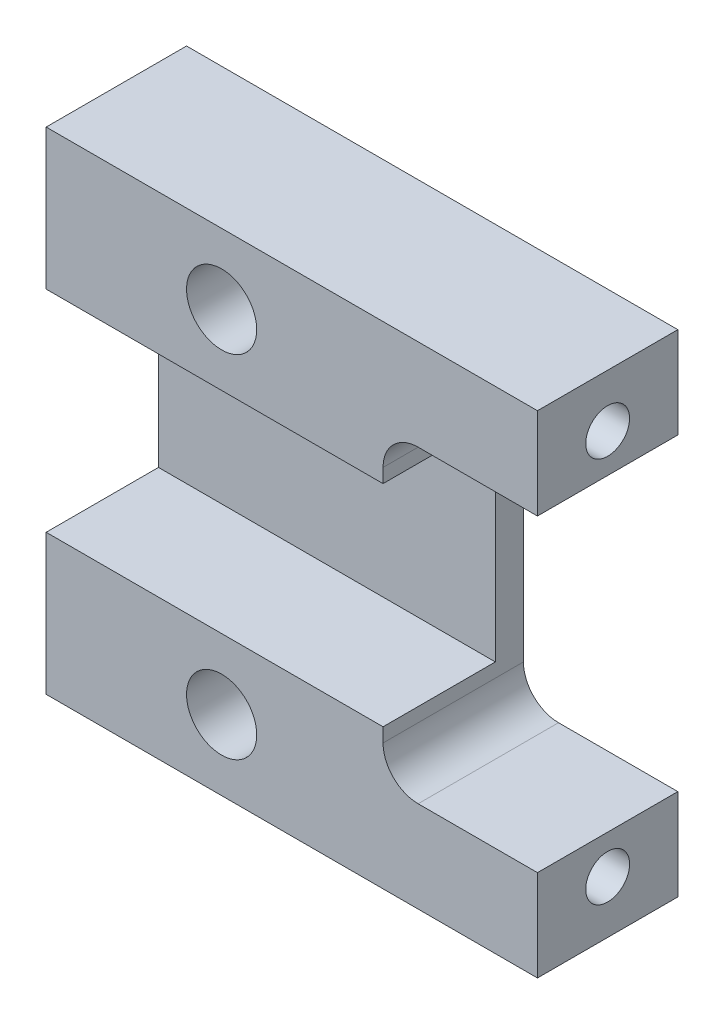
ISO-10303-21;
HEADER;
FILE_DESCRIPTION(('STEP AP214'),'2;1');
FILE_NAME('part.step','',(''),(''),'','','');
FILE_SCHEMA(('AUTOMOTIVE_DESIGN { 1 0 10303 214 1 1 1 1 }'));
ENDSEC;
DATA;
#1=APPLICATION_CONTEXT('core data for automotive mechanical design processes');
#2=APPLICATION_PROTOCOL_DEFINITION('international standard','automotive_design',2000,#1);
#3=PRODUCT_CONTEXT('',#1,'mechanical');
#4=PRODUCT('Part','Part','',(#3));
#5=PRODUCT_RELATED_PRODUCT_CATEGORY('part','',(#4));
#6=PRODUCT_DEFINITION_FORMATION('','',#4);
#7=PRODUCT_DEFINITION_CONTEXT('part definition',#1,'design');
#8=PRODUCT_DEFINITION('design','',#6,#7);
#9=PRODUCT_DEFINITION_SHAPE('','',#8);
#10=(LENGTH_UNIT() NAMED_UNIT(*) SI_UNIT(.MILLI.,.METRE.));
#11=(NAMED_UNIT(*) PLANE_ANGLE_UNIT() SI_UNIT($,.RADIAN.));
#12=(NAMED_UNIT(*) SI_UNIT($,.STERADIAN.) SOLID_ANGLE_UNIT());
#13=UNCERTAINTY_MEASURE_WITH_UNIT(LENGTH_MEASURE(1.E-05),#10,'distance_accuracy_value','');
#14=(GEOMETRIC_REPRESENTATION_CONTEXT(3) GLOBAL_UNCERTAINTY_ASSIGNED_CONTEXT((#13)) GLOBAL_UNIT_ASSIGNED_CONTEXT((#10,
#11,#12)) REPRESENTATION_CONTEXT('',''));
#15=CARTESIAN_POINT('',(0.,0.,0.));
#16=DIRECTION('',(0.,0.,1.));
#17=DIRECTION('',(1.,0.,0.));
#18=AXIS2_PLACEMENT_3D('',#15,#16,#17);
#19=CARTESIAN_POINT('',(44.45,-44.45,25.4));
#20=DIRECTION('',(-1.,0.,0.));
#21=DIRECTION('',(0.,0.,1.));
#22=AXIS2_PLACEMENT_3D('',#19,#20,#21);
#23=PLANE('',#22);
#24=CARTESIAN_POINT('',(44.45,34.925,12.7));
#25=DIRECTION('',(1.,0.,0.));
#26=DIRECTION('',(0.,0.,-1.));
#27=AXIS2_PLACEMENT_3D('',#24,#25,#26);
#28=CIRCLE('',#27,3.96875);
#29=CARTESIAN_POINT('',(44.45,34.925,8.73125));
#30=VERTEX_POINT('',#29);
#31=EDGE_CURVE('E241',#30,#30,#28,.T.);
#32=ORIENTED_EDGE('',*,*,#31,.F.);
#33=EDGE_LOOP('',(#32));
#34=FACE_BOUND('',#33,.T.);
#35=DIRECTION('',(0.,0.,1.));
#36=VECTOR('',#35,1.);
#37=CARTESIAN_POINT('',(44.45,27.94,5.08));
#38=LINE('',#37,#36);
#39=CARTESIAN_POINT('',(44.45,27.94,0.));
#40=VERTEX_POINT('',#39);
#41=CARTESIAN_POINT('',(44.45,27.94,25.4));
#42=VERTEX_POINT('',#41);
#43=EDGE_CURVE('E211',#40,#42,#38,.T.);
#44=ORIENTED_EDGE('',*,*,#43,.F.);
#45=DIRECTION('',(0.,1.,0.));
#46=VECTOR('',#45,1.);
#47=CARTESIAN_POINT('',(44.45,-44.45,0.));
#48=LINE('',#47,#46);
#49=CARTESIAN_POINT('',(44.45,44.45,0.));
#50=VERTEX_POINT('',#49);
#51=EDGE_CURVE('E247',#40,#50,#48,.T.);
#52=ORIENTED_EDGE('',*,*,#51,.T.);
#53=DIRECTION('',(0.,0.,-1.));
#54=VECTOR('',#53,1.);
#55=CARTESIAN_POINT('',(44.45,44.45,25.4));
#56=LINE('',#55,#54);
#57=CARTESIAN_POINT('',(44.45,44.45,25.4));
#58=VERTEX_POINT('',#57);
#59=EDGE_CURVE('E278',#58,#50,#56,.T.);
#60=ORIENTED_EDGE('',*,*,#59,.F.);
#61=DIRECTION('',(0.,1.,0.));
#62=VECTOR('',#61,1.);
#63=CARTESIAN_POINT('',(44.45,-44.45,25.4));
#64=LINE('',#63,#62);
#65=EDGE_CURVE('E252',#42,#58,#64,.T.);
#66=ORIENTED_EDGE('',*,*,#65,.F.);
#67=EDGE_LOOP('',(#44,#52,#60,#66));
#68=FACE_BOUND('',#67,.T.);
#69=ADVANCED_FACE('F44',(#34,#68),#23,.F.);
#70=CARTESIAN_POINT('',(44.45,44.45,25.4));
#71=DIRECTION('',(0.,0.,-1.));
#72=DIRECTION('',(-1.,0.,0.));
#73=AXIS2_PLACEMENT_3D('',#70,#71,#72);
#74=PLANE('',#73);
#75=CARTESIAN_POINT('',(-12.7,-31.75,25.4));
#76=DIRECTION('',(0.,0.,1.));
#77=DIRECTION('',(1.,0.,0.));
#78=AXIS2_PLACEMENT_3D('',#75,#76,#77);
#79=CIRCLE('',#78,6.34999999999999);
#80=CARTESIAN_POINT('',(-6.35000000000002,-31.75,25.4));
#81=VERTEX_POINT('',#80);
#82=EDGE_CURVE('E219',#81,#81,#79,.T.);
#83=ORIENTED_EDGE('',*,*,#82,.F.);
#84=EDGE_LOOP('',(#83));
#85=FACE_BOUND('',#84,.T.);
#86=DIRECTION('',(-1.,0.,0.));
#87=VECTOR('',#86,1.);
#88=CARTESIAN_POINT('',(16.51,-27.94,25.4));
#89=LINE('',#88,#87);
#90=CARTESIAN_POINT('',(44.45,-27.94,25.4));
#91=VERTEX_POINT('',#90);
#92=CARTESIAN_POINT('',(22.86,-27.94,25.4));
#93=VERTEX_POINT('',#92);
#94=EDGE_CURVE('E190',#91,#93,#89,.T.);
#95=ORIENTED_EDGE('',*,*,#94,.T.);
#96=CARTESIAN_POINT('',(22.86,-21.59,25.4));
#97=DIRECTION('',(0.,0.,-1.));
#98=DIRECTION('',(-1.,0.,0.));
#99=AXIS2_PLACEMENT_3D('',#96,#97,#98);
#100=CIRCLE('',#99,6.35);
#101=CARTESIAN_POINT('',(16.51,-21.59,25.4));
#102=VERTEX_POINT('',#101);
#103=EDGE_CURVE('E290',#93,#102,#100,.T.);
#104=ORIENTED_EDGE('',*,*,#103,.T.);
#105=DIRECTION('',(0.,1.,0.));
#106=VECTOR('',#105,1.);
#107=CARTESIAN_POINT('',(16.51,-19.05,25.4));
#108=LINE('',#107,#106);
#109=CARTESIAN_POINT('',(16.51,-19.05,25.4));
#110=VERTEX_POINT('',#109);
#111=EDGE_CURVE('E193',#102,#110,#108,.T.);
#112=ORIENTED_EDGE('',*,*,#111,.T.);
#113=DIRECTION('',(-1.,0.,0.));
#114=VECTOR('',#113,1.);
#115=CARTESIAN_POINT('',(-44.45,-19.05,25.4));
#116=LINE('',#115,#114);
#117=CARTESIAN_POINT('',(-44.45,-19.05,25.4));
#118=VERTEX_POINT('',#117);
#119=EDGE_CURVE('E184',#110,#118,#116,.T.);
#120=ORIENTED_EDGE('',*,*,#119,.T.);
#121=DIRECTION('',(0.,-1.,0.));
#122=VECTOR('',#121,1.);
#123=CARTESIAN_POINT('',(-44.45,-44.45,25.4));
#124=LINE('',#123,#122);
#125=CARTESIAN_POINT('',(-44.45,-44.45,25.4));
#126=VERTEX_POINT('',#125);
#127=EDGE_CURVE('E254',#118,#126,#124,.T.);
#128=ORIENTED_EDGE('',*,*,#127,.T.);
#129=DIRECTION('',(1.,0.,0.));
#130=VECTOR('',#129,1.);
#131=CARTESIAN_POINT('',(-44.45,-44.45,25.4));
#132=LINE('',#131,#130);
#133=CARTESIAN_POINT('',(44.45,-44.45,25.4));
#134=VERTEX_POINT('',#133);
#135=EDGE_CURVE('E258',#126,#134,#132,.T.);
#136=ORIENTED_EDGE('',*,*,#135,.T.);
#137=EDGE_CURVE('E248',#134,#91,#64,.T.);
#138=ORIENTED_EDGE('',*,*,#137,.T.);
#139=EDGE_LOOP('',(#95,#104,#112,#120,#128,#136,#138));
#140=FACE_BOUND('',#139,.T.);
#141=ADVANCED_FACE('F309',(#85,#140),#74,.F.);
#142=CARTESIAN_POINT('',(44.45,-34.925,12.7));
#143=DIRECTION('',(1.,0.,0.));
#144=DIRECTION('',(0.,0.,-1.));
#145=AXIS2_PLACEMENT_3D('',#142,#143,#144);
#146=CIRCLE('',#145,3.96875);
#147=CARTESIAN_POINT('',(44.45,-34.925,8.73125));
#148=VERTEX_POINT('',#147);
#149=EDGE_CURVE('E235',#148,#148,#146,.T.);
#150=ORIENTED_EDGE('',*,*,#149,.F.);
#151=EDGE_LOOP('',(#150));
#152=FACE_BOUND('',#151,.T.);
#153=CARTESIAN_POINT('',(44.45,-44.45,0.));
#154=VERTEX_POINT('',#153);
#155=CARTESIAN_POINT('',(44.45,-27.94,0.));
#156=VERTEX_POINT('',#155);
#157=EDGE_CURVE('E261',#154,#156,#48,.T.);
#158=ORIENTED_EDGE('',*,*,#157,.T.);
#159=DIRECTION('',(0.,0.,1.));
#160=VECTOR('',#159,1.);
#161=CARTESIAN_POINT('',(44.45,-27.94,5.08));
#162=LINE('',#161,#160);
#163=EDGE_CURVE('E197',#156,#91,#162,.T.);
#164=ORIENTED_EDGE('',*,*,#163,.T.);
#165=ORIENTED_EDGE('',*,*,#137,.F.);
#166=DIRECTION('',(0.,0.,-1.));
#167=VECTOR('',#166,1.);
#168=CARTESIAN_POINT('',(44.45,-44.45,25.4));
#169=LINE('',#168,#167);
#170=EDGE_CURVE('E260',#134,#154,#169,.T.);
#171=ORIENTED_EDGE('',*,*,#170,.T.);
#172=EDGE_LOOP('',(#158,#164,#165,#171));
#173=FACE_BOUND('',#172,.T.);
#174=ADVANCED_FACE('F332',(#152,#173),#23,.F.);
#175=CARTESIAN_POINT('',(-44.45,-44.45,25.4));
#176=DIRECTION('',(1.,0.,0.));
#177=DIRECTION('',(0.,0.,-1.));
#178=AXIS2_PLACEMENT_3D('',#175,#176,#177);
#179=PLANE('',#178);
#180=CARTESIAN_POINT('',(-44.45,-31.75,12.7));
#181=DIRECTION('',(-1.,0.,0.));
#182=DIRECTION('',(0.,0.,1.));
#183=AXIS2_PLACEMENT_3D('',#180,#181,#182);
#184=CIRCLE('',#183,5.35813);
#185=CARTESIAN_POINT('',(-44.45,-31.75,18.05813));
#186=VERTEX_POINT('',#185);
#187=EDGE_CURVE('E166',#186,#186,#184,.T.);
#188=ORIENTED_EDGE('',*,*,#187,.F.);
#189=EDGE_LOOP('',(#188));
#190=FACE_BOUND('',#189,.T.);
#191=CARTESIAN_POINT('',(-44.45,31.75,12.7));
#192=DIRECTION('',(-1.,0.,0.));
#193=DIRECTION('',(0.,0.,1.));
#194=AXIS2_PLACEMENT_3D('',#191,#192,#193);
#195=CIRCLE('',#194,5.35813);
#196=CARTESIAN_POINT('',(-44.45,31.75,18.05813));
#197=VERTEX_POINT('',#196);
#198=EDGE_CURVE('E165',#197,#197,#195,.T.);
#199=ORIENTED_EDGE('',*,*,#198,.F.);
#200=EDGE_LOOP('',(#199));
#201=FACE_BOUND('',#200,.T.);
#202=DIRECTION('',(0.,0.,1.));
#203=VECTOR('',#202,1.);
#204=CARTESIAN_POINT('',(-44.45,-19.05,5.08));
#205=LINE('',#204,#203);
#206=CARTESIAN_POINT('',(-44.45,-19.05,5.08));
#207=VERTEX_POINT('',#206);
#208=EDGE_CURVE('E189',#207,#118,#205,.T.);
#209=ORIENTED_EDGE('',*,*,#208,.F.);
#210=DIRECTION('',(0.,-1.,0.));
#211=VECTOR('',#210,1.);
#212=CARTESIAN_POINT('',(-44.45,0.,5.08));
#213=LINE('',#212,#211);
#214=CARTESIAN_POINT('',(-44.45,19.05,5.08));
#215=VERTEX_POINT('',#214);
#216=EDGE_CURVE('E208',#215,#207,#213,.T.);
#217=ORIENTED_EDGE('',*,*,#216,.F.);
#218=DIRECTION('',(0.,0.,1.));
#219=VECTOR('',#218,1.);
#220=CARTESIAN_POINT('',(-44.45,19.05,5.08));
#221=LINE('',#220,#219);
#222=CARTESIAN_POINT('',(-44.45,19.05,25.4));
#223=VERTEX_POINT('',#222);
#224=EDGE_CURVE('E216',#215,#223,#221,.T.);
#225=ORIENTED_EDGE('',*,*,#224,.T.);
#226=CARTESIAN_POINT('',(-44.45,44.45,25.4));
#227=VERTEX_POINT('',#226);
#228=EDGE_CURVE('E255',#227,#223,#124,.T.);
#229=ORIENTED_EDGE('',*,*,#228,.F.);
#230=DIRECTION('',(0.,0.,-1.));
#231=VECTOR('',#230,1.);
#232=CARTESIAN_POINT('',(-44.45,44.45,25.4));
#233=LINE('',#232,#231);
#234=CARTESIAN_POINT('',(-44.45,44.45,0.));
#235=VERTEX_POINT('',#234);
#236=EDGE_CURVE('E275',#227,#235,#233,.T.);
#237=ORIENTED_EDGE('',*,*,#236,.T.);
#238=DIRECTION('',(0.,-1.,0.));
#239=VECTOR('',#238,1.);
#240=CARTESIAN_POINT('',(-44.45,-44.45,0.));
#241=LINE('',#240,#239);
#242=CARTESIAN_POINT('',(-44.45,-44.45,0.));
#243=VERTEX_POINT('',#242);
#244=EDGE_CURVE('E266',#235,#243,#241,.T.);
#245=ORIENTED_EDGE('',*,*,#244,.T.);
#246=DIRECTION('',(0.,0.,-1.));
#247=VECTOR('',#246,1.);
#248=CARTESIAN_POINT('',(-44.45,-44.45,25.4));
#249=LINE('',#248,#247);
#250=EDGE_CURVE('E272',#126,#243,#249,.T.);
#251=ORIENTED_EDGE('',*,*,#250,.F.);
#252=ORIENTED_EDGE('',*,*,#127,.F.);
#253=EDGE_LOOP('',(#209,#217,#225,#229,#237,#245,#251,#252));
#254=FACE_BOUND('',#253,.T.);
#255=ADVANCED_FACE('F322',(#190,#201,#254),#179,.F.);
#256=CARTESIAN_POINT('',(-44.45,44.45,25.4));
#257=DIRECTION('',(0.,-1.,0.));
#258=DIRECTION('',(0.,0.,-1.));
#259=AXIS2_PLACEMENT_3D('',#256,#257,#258);
#260=PLANE('',#259);
#261=DIRECTION('',(-1.,0.,0.));
#262=VECTOR('',#261,1.);
#263=CARTESIAN_POINT('',(-44.45,44.45,0.));
#264=LINE('',#263,#262);
#265=EDGE_CURVE('E264',#50,#235,#264,.T.);
#266=ORIENTED_EDGE('',*,*,#265,.T.);
#267=ORIENTED_EDGE('',*,*,#236,.F.);
#268=DIRECTION('',(-1.,0.,0.));
#269=VECTOR('',#268,1.);
#270=CARTESIAN_POINT('',(-44.45,44.45,25.4));
#271=LINE('',#270,#269);
#272=EDGE_CURVE('E251',#58,#227,#271,.T.);
#273=ORIENTED_EDGE('',*,*,#272,.F.);
#274=ORIENTED_EDGE('',*,*,#59,.T.);
#275=EDGE_LOOP('',(#266,#267,#273,#274));
#276=FACE_BOUND('',#275,.T.);
#277=ADVANCED_FACE('F339',(#276),#260,.F.);
#278=CARTESIAN_POINT('',(-44.45,-44.45,25.4));
#279=DIRECTION('',(0.,1.,0.));
#280=DIRECTION('',(0.,0.,1.));
#281=AXIS2_PLACEMENT_3D('',#278,#279,#280);
#282=PLANE('',#281);
#283=DIRECTION('',(1.,0.,0.));
#284=VECTOR('',#283,1.);
#285=CARTESIAN_POINT('',(-44.45,-44.45,0.));
#286=LINE('',#285,#284);
#287=EDGE_CURVE('E268',#243,#154,#286,.T.);
#288=ORIENTED_EDGE('',*,*,#287,.T.);
#289=ORIENTED_EDGE('',*,*,#170,.F.);
#290=ORIENTED_EDGE('',*,*,#135,.F.);
#291=ORIENTED_EDGE('',*,*,#250,.T.);
#292=EDGE_LOOP('',(#288,#289,#290,#291));
#293=FACE_BOUND('',#292,.T.);
#294=ADVANCED_FACE('F329',(#293),#282,.F.);
#295=CARTESIAN_POINT('',(-12.7,31.75,25.4));
#296=DIRECTION('',(0.,0.,1.));
#297=DIRECTION('',(1.,0.,0.));
#298=AXIS2_PLACEMENT_3D('',#295,#296,#297);
#299=CIRCLE('',#298,6.34999999999999);
#300=CARTESIAN_POINT('',(-6.35000000000002,31.75,25.4));
#301=VERTEX_POINT('',#300);
#302=EDGE_CURVE('E229',#301,#301,#299,.T.);
#303=ORIENTED_EDGE('',*,*,#302,.F.);
#304=EDGE_LOOP('',(#303));
#305=FACE_BOUND('',#304,.T.);
#306=ORIENTED_EDGE('',*,*,#228,.T.);
#307=DIRECTION('',(-1.,0.,0.));
#308=VECTOR('',#307,1.);
#309=CARTESIAN_POINT('',(-44.45,19.05,25.4));
#310=LINE('',#309,#308);
#311=CARTESIAN_POINT('',(16.51,19.05,25.4));
#312=VERTEX_POINT('',#311);
#313=EDGE_CURVE('E209',#312,#223,#310,.T.);
#314=ORIENTED_EDGE('',*,*,#313,.F.);
#315=DIRECTION('',(0.,-1.,0.));
#316=VECTOR('',#315,1.);
#317=CARTESIAN_POINT('',(16.51,19.05,25.4));
#318=LINE('',#317,#316);
#319=CARTESIAN_POINT('',(16.51,21.59,25.4));
#320=VERTEX_POINT('',#319);
#321=EDGE_CURVE('E213',#320,#312,#318,.T.);
#322=ORIENTED_EDGE('',*,*,#321,.F.);
#323=CARTESIAN_POINT('',(22.86,21.59,25.4));
#324=DIRECTION('',(0.,0.,-1.));
#325=DIRECTION('',(-1.,0.,0.));
#326=AXIS2_PLACEMENT_3D('',#323,#324,#325);
#327=CIRCLE('',#326,6.35);
#328=CARTESIAN_POINT('',(22.86,27.94,25.4));
#329=VERTEX_POINT('',#328);
#330=EDGE_CURVE('E52',#320,#329,#327,.T.);
#331=ORIENTED_EDGE('',*,*,#330,.T.);
#332=DIRECTION('',(-1.,0.,0.));
#333=VECTOR('',#332,1.);
#334=CARTESIAN_POINT('',(16.51,27.94,25.4));
#335=LINE('',#334,#333);
#336=EDGE_CURVE('E200',#42,#329,#335,.T.);
#337=ORIENTED_EDGE('',*,*,#336,.F.);
#338=ORIENTED_EDGE('',*,*,#65,.T.);
#339=ORIENTED_EDGE('',*,*,#272,.T.);
#340=EDGE_LOOP('',(#306,#314,#322,#331,#337,#338,#339));
#341=FACE_BOUND('',#340,.T.);
#342=ADVANCED_FACE('F347',(#305,#341),#74,.F.);
#343=CARTESIAN_POINT('',(44.45,44.45,0.));
#344=DIRECTION('',(0.,0.,-1.));
#345=DIRECTION('',(-1.,0.,0.));
#346=AXIS2_PLACEMENT_3D('',#343,#344,#345);
#347=PLANE('',#346);
#348=DIRECTION('',(-1.,0.,0.));
#349=VECTOR('',#348,1.);
#350=CARTESIAN_POINT('',(16.51,27.94,0.));
#351=LINE('',#350,#349);
#352=CARTESIAN_POINT('',(22.86,27.94,0.));
#353=VERTEX_POINT('',#352);
#354=EDGE_CURVE('E182',#40,#353,#351,.T.);
#355=ORIENTED_EDGE('',*,*,#354,.T.);
#356=CARTESIAN_POINT('',(22.86,21.59,0.));
#357=DIRECTION('',(0.,0.,-1.));
#358=DIRECTION('',(-1.,0.,0.));
#359=AXIS2_PLACEMENT_3D('',#356,#357,#358);
#360=CIRCLE('',#359,6.35);
#361=CARTESIAN_POINT('',(16.51,21.59,0.));
#362=VERTEX_POINT('',#361);
#363=EDGE_CURVE('E13',#353,#362,#360,.F.);
#364=ORIENTED_EDGE('',*,*,#363,.T.);
#365=DIRECTION('',(0.,-1.,0.));
#366=VECTOR('',#365,1.);
#367=CARTESIAN_POINT('',(16.51,27.94,0.));
#368=LINE('',#367,#366);
#369=CARTESIAN_POINT('',(16.51,-21.59,0.));
#370=VERTEX_POINT('',#369);
#371=EDGE_CURVE('E177',#362,#370,#368,.T.);
#372=ORIENTED_EDGE('',*,*,#371,.T.);
#373=CARTESIAN_POINT('',(22.86,-21.59,0.));
#374=DIRECTION('',(0.,0.,-1.));
#375=DIRECTION('',(-1.,0.,0.));
#376=AXIS2_PLACEMENT_3D('',#373,#374,#375);
#377=CIRCLE('',#376,6.35);
#378=CARTESIAN_POINT('',(22.86,-27.94,0.));
#379=VERTEX_POINT('',#378);
#380=EDGE_CURVE('E292',#370,#379,#377,.F.);
#381=ORIENTED_EDGE('',*,*,#380,.T.);
#382=DIRECTION('',(1.,0.,0.));
#383=VECTOR('',#382,1.);
#384=CARTESIAN_POINT('',(16.51,-27.94,0.));
#385=LINE('',#384,#383);
#386=EDGE_CURVE('E180',#379,#156,#385,.T.);
#387=ORIENTED_EDGE('',*,*,#386,.T.);
#388=ORIENTED_EDGE('',*,*,#157,.F.);
#389=ORIENTED_EDGE('',*,*,#287,.F.);
#390=ORIENTED_EDGE('',*,*,#244,.F.);
#391=ORIENTED_EDGE('',*,*,#265,.F.);
#392=ORIENTED_EDGE('',*,*,#51,.F.);
#393=EDGE_LOOP('',(#355,#364,#372,#381,#387,#388,#389,#390,#391,#392));
#394=FACE_BOUND('',#393,.T.);
#395=CARTESIAN_POINT('',(-12.7,-31.75,0.));
#396=DIRECTION('',(0.,0.,1.));
#397=DIRECTION('',(1.,0.,0.));
#398=AXIS2_PLACEMENT_3D('',#395,#396,#397);
#399=CIRCLE('',#398,6.34999999999999);
#400=CARTESIAN_POINT('',(-6.35000000000001,-31.75,0.));
#401=VERTEX_POINT('',#400);
#402=EDGE_CURVE('E226',#401,#401,#399,.T.);
#403=ORIENTED_EDGE('',*,*,#402,.T.);
#404=EDGE_LOOP('',(#403));
#405=FACE_BOUND('',#404,.T.);
#406=CARTESIAN_POINT('',(-12.7,31.75,0.));
#407=DIRECTION('',(0.,0.,1.));
#408=DIRECTION('',(1.,0.,0.));
#409=AXIS2_PLACEMENT_3D('',#406,#407,#408);
#410=CIRCLE('',#409,6.34999999999999);
#411=CARTESIAN_POINT('',(-6.35000000000001,31.75,0.));
#412=VERTEX_POINT('',#411);
#413=EDGE_CURVE('E232',#412,#412,#410,.T.);
#414=ORIENTED_EDGE('',*,*,#413,.T.);
#415=EDGE_LOOP('',(#414));
#416=FACE_BOUND('',#415,.T.);
#417=ADVANCED_FACE('F296',(#394,#405,#416),#347,.T.);
#418=CARTESIAN_POINT('',(26.67,34.925,12.7));
#419=DIRECTION('',(1.,0.,0.));
#420=DIRECTION('',(0.,0.,-1.));
#421=AXIS2_PLACEMENT_3D('',#418,#419,#420);
#422=CONICAL_SURFACE('',#421,3.96874999999999,1.02974425867665);
#423=CARTESIAN_POINT('',(24.2853344182344,34.925,12.7));
#424=VERTEX_POINT('',#423);
#425=VERTEX_LOOP('',#424);
#426=FACE_BOUND('',#425,.T.);
#427=CARTESIAN_POINT('',(26.67,34.925,12.7));
#428=DIRECTION('',(1.,0.,0.));
#429=DIRECTION('',(0.,0.,-1.));
#430=AXIS2_PLACEMENT_3D('',#427,#428,#429);
#431=CIRCLE('',#430,3.96874999999999);
#432=CARTESIAN_POINT('',(26.67,34.925,8.73125));
#433=VERTEX_POINT('',#432);
#434=EDGE_CURVE('E244',#433,#433,#431,.T.);
#435=ORIENTED_EDGE('',*,*,#434,.T.);
#436=EDGE_LOOP('',(#435));
#437=FACE_BOUND('',#436,.T.);
#438=ADVANCED_FACE('F404',(#426,#437),#422,.F.);
#439=CARTESIAN_POINT('',(44.45,34.925,12.7));
#440=DIRECTION('',(1.,0.,0.));
#441=DIRECTION('',(0.,0.,-1.));
#442=AXIS2_PLACEMENT_3D('',#439,#440,#441);
#443=CYLINDRICAL_SURFACE('',#442,3.96875);
#444=ORIENTED_EDGE('',*,*,#434,.F.);
#445=EDGE_LOOP('',(#444));
#446=FACE_BOUND('',#445,.T.);
#447=ORIENTED_EDGE('',*,*,#31,.T.);
#448=EDGE_LOOP('',(#447));
#449=FACE_BOUND('',#448,.T.);
#450=ADVANCED_FACE('F396',(#446,#449),#443,.F.);
#451=CARTESIAN_POINT('',(26.67,-34.925,12.7));
#452=DIRECTION('',(1.,0.,0.));
#453=DIRECTION('',(0.,0.,-1.));
#454=AXIS2_PLACEMENT_3D('',#451,#452,#453);
#455=CONICAL_SURFACE('',#454,3.96875,1.02974425867665);
#456=CARTESIAN_POINT('',(24.2853344182344,-34.925,12.7));
#457=VERTEX_POINT('',#456);
#458=VERTEX_LOOP('',#457);
#459=FACE_BOUND('',#458,.T.);
#460=CARTESIAN_POINT('',(26.67,-34.925,12.7));
#461=DIRECTION('',(1.,0.,0.));
#462=DIRECTION('',(0.,0.,-1.));
#463=AXIS2_PLACEMENT_3D('',#460,#461,#462);
#464=CIRCLE('',#463,3.96875);
#465=CARTESIAN_POINT('',(26.67,-34.925,8.73125));
#466=VERTEX_POINT('',#465);
#467=EDGE_CURVE('E238',#466,#466,#464,.T.);
#468=ORIENTED_EDGE('',*,*,#467,.T.);
#469=EDGE_LOOP('',(#468));
#470=FACE_BOUND('',#469,.T.);
#471=ADVANCED_FACE('F386',(#459,#470),#455,.F.);
#472=CARTESIAN_POINT('',(44.45,-34.925,12.7));
#473=DIRECTION('',(1.,0.,0.));
#474=DIRECTION('',(0.,0.,-1.));
#475=AXIS2_PLACEMENT_3D('',#472,#473,#474);
#476=CYLINDRICAL_SURFACE('',#475,3.96875);
#477=ORIENTED_EDGE('',*,*,#467,.F.);
#478=EDGE_LOOP('',(#477));
#479=FACE_BOUND('',#478,.T.);
#480=ORIENTED_EDGE('',*,*,#149,.T.);
#481=EDGE_LOOP('',(#480));
#482=FACE_BOUND('',#481,.T.);
#483=ADVANCED_FACE('F383',(#479,#482),#476,.F.);
#484=CARTESIAN_POINT('',(-12.7,31.75,25.4));
#485=DIRECTION('',(0.,0.,1.));
#486=DIRECTION('',(1.,0.,0.));
#487=AXIS2_PLACEMENT_3D('',#484,#485,#486);
#488=CYLINDRICAL_SURFACE('',#487,6.34999999999999);
#489=ORIENTED_EDGE('',*,*,#413,.F.);
#490=EDGE_LOOP('',(#489));
#491=FACE_BOUND('',#490,.T.);
#492=ORIENTED_EDGE('',*,*,#302,.T.);
#493=EDGE_LOOP('',(#492));
#494=FACE_BOUND('',#493,.T.);
#495=ADVANCED_FACE('F385',(#491,#494),#488,.F.);
#496=CARTESIAN_POINT('',(-12.7,-31.75,25.4));
#497=DIRECTION('',(0.,0.,1.));
#498=DIRECTION('',(1.,0.,0.));
#499=AXIS2_PLACEMENT_3D('',#496,#497,#498);
#500=CYLINDRICAL_SURFACE('',#499,6.34999999999999);
#501=ORIENTED_EDGE('',*,*,#402,.F.);
#502=EDGE_LOOP('',(#501));
#503=FACE_BOUND('',#502,.T.);
#504=ORIENTED_EDGE('',*,*,#82,.T.);
#505=EDGE_LOOP('',(#504));
#506=FACE_BOUND('',#505,.T.);
#507=ADVANCED_FACE('F393',(#503,#506),#500,.F.);
#508=CARTESIAN_POINT('',(-44.45,19.05,5.08));
#509=DIRECTION('',(0.,1.,0.));
#510=DIRECTION('',(0.,0.,1.));
#511=AXIS2_PLACEMENT_3D('',#508,#509,#510);
#512=PLANE('',#511);
#513=ORIENTED_EDGE('',*,*,#313,.T.);
#514=ORIENTED_EDGE('',*,*,#224,.F.);
#515=DIRECTION('',(-1.,0.,0.));
#516=VECTOR('',#515,1.);
#517=CARTESIAN_POINT('',(-44.45,19.05,5.08));
#518=LINE('',#517,#516);
#519=CARTESIAN_POINT('',(16.51,19.05,5.08));
#520=VERTEX_POINT('',#519);
#521=EDGE_CURVE('E205',#520,#215,#518,.T.);
#522=ORIENTED_EDGE('',*,*,#521,.F.);
#523=DIRECTION('',(0.,0.,1.));
#524=VECTOR('',#523,1.);
#525=CARTESIAN_POINT('',(16.51,19.05,5.08));
#526=LINE('',#525,#524);
#527=EDGE_CURVE('E220',#520,#312,#526,.T.);
#528=ORIENTED_EDGE('',*,*,#527,.T.);
#529=EDGE_LOOP('',(#513,#514,#522,#528));
#530=FACE_BOUND('',#529,.T.);
#531=ADVANCED_FACE('F350',(#530),#512,.F.);
#532=CARTESIAN_POINT('',(16.51,19.05,5.08));
#533=DIRECTION('',(-1.,0.,0.));
#534=DIRECTION('',(0.,0.,1.));
#535=AXIS2_PLACEMENT_3D('',#532,#533,#534);
#536=PLANE('',#535);
#537=ORIENTED_EDGE('',*,*,#111,.F.);
#538=DIRECTION('',(0.,0.,1.));
#539=VECTOR('',#538,1.);
#540=CARTESIAN_POINT('',(16.51,-21.59,5.08));
#541=LINE('',#540,#539);
#542=EDGE_CURVE('E287',#102,#370,#541,.F.);
#543=ORIENTED_EDGE('',*,*,#542,.T.);
#544=ORIENTED_EDGE('',*,*,#371,.F.);
#545=DIRECTION('',(0.,0.,1.));
#546=VECTOR('',#545,1.);
#547=CARTESIAN_POINT('',(16.51,21.59,25.4));
#548=LINE('',#547,#546);
#549=EDGE_CURVE('E284',#362,#320,#548,.T.);
#550=ORIENTED_EDGE('',*,*,#549,.T.);
#551=ORIENTED_EDGE('',*,*,#321,.T.);
#552=ORIENTED_EDGE('',*,*,#527,.F.);
#553=DIRECTION('',(0.,-1.,0.));
#554=VECTOR('',#553,1.);
#555=CARTESIAN_POINT('',(16.51,27.94,5.08));
#556=LINE('',#555,#554);
#557=CARTESIAN_POINT('',(16.51,-19.05,5.08));
#558=VERTEX_POINT('',#557);
#559=EDGE_CURVE('E176',#520,#558,#556,.T.);
#560=ORIENTED_EDGE('',*,*,#559,.T.);
#561=DIRECTION('',(0.,0.,1.));
#562=VECTOR('',#561,1.);
#563=CARTESIAN_POINT('',(16.51,-19.05,5.08));
#564=LINE('',#563,#562);
#565=EDGE_CURVE('E201',#558,#110,#564,.T.);
#566=ORIENTED_EDGE('',*,*,#565,.T.);
#567=EDGE_LOOP('',(#537,#543,#544,#550,#551,#552,#560,#566));
#568=FACE_BOUND('',#567,.T.);
#569=ADVANCED_FACE('F311',(#568),#536,.F.);
#570=CARTESIAN_POINT('',(16.51,27.94,5.08));
#571=DIRECTION('',(0.,1.,0.));
#572=DIRECTION('',(0.,0.,1.));
#573=AXIS2_PLACEMENT_3D('',#570,#571,#572);
#574=PLANE('',#573);
#575=ORIENTED_EDGE('',*,*,#336,.T.);
#576=DIRECTION('',(0.,0.,1.));
#577=VECTOR('',#576,1.);
#578=CARTESIAN_POINT('',(22.86,27.94,0.));
#579=LINE('',#578,#577);
#580=EDGE_CURVE('E59',#329,#353,#579,.F.);
#581=ORIENTED_EDGE('',*,*,#580,.T.);
#582=ORIENTED_EDGE('',*,*,#354,.F.);
#583=ORIENTED_EDGE('',*,*,#43,.T.);
#584=EDGE_LOOP('',(#575,#581,#582,#583));
#585=FACE_BOUND('',#584,.T.);
#586=ADVANCED_FACE('F342',(#585),#574,.F.);
#587=CARTESIAN_POINT('',(-44.45,0.,5.08));
#588=DIRECTION('',(0.,0.,-1.));
#589=DIRECTION('',(-1.,0.,0.));
#590=AXIS2_PLACEMENT_3D('',#587,#588,#589);
#591=PLANE('',#590);
#592=DIRECTION('',(-1.,0.,0.));
#593=VECTOR('',#592,1.);
#594=CARTESIAN_POINT('',(-44.45,-19.05,5.08));
#595=LINE('',#594,#593);
#596=EDGE_CURVE('E186',#558,#207,#595,.T.);
#597=ORIENTED_EDGE('',*,*,#596,.F.);
#598=ORIENTED_EDGE('',*,*,#559,.F.);
#599=ORIENTED_EDGE('',*,*,#521,.T.);
#600=ORIENTED_EDGE('',*,*,#216,.T.);
#601=EDGE_LOOP('',(#597,#598,#599,#600));
#602=FACE_BOUND('',#601,.T.);
#603=ADVANCED_FACE('F353',(#602),#591,.F.);
#604=CARTESIAN_POINT('',(16.51,-27.94,5.08));
#605=DIRECTION('',(0.,1.,0.));
#606=DIRECTION('',(0.,0.,1.));
#607=AXIS2_PLACEMENT_3D('',#604,#605,#606);
#608=PLANE('',#607);
#609=ORIENTED_EDGE('',*,*,#386,.F.);
#610=DIRECTION('',(0.,0.,1.));
#611=VECTOR('',#610,1.);
#612=CARTESIAN_POINT('',(22.86,-27.94,5.08));
#613=LINE('',#612,#611);
#614=EDGE_CURVE('E281',#379,#93,#613,.T.);
#615=ORIENTED_EDGE('',*,*,#614,.T.);
#616=ORIENTED_EDGE('',*,*,#94,.F.);
#617=ORIENTED_EDGE('',*,*,#163,.F.);
#618=EDGE_LOOP('',(#609,#615,#616,#617));
#619=FACE_BOUND('',#618,.T.);
#620=ADVANCED_FACE('F305',(#619),#608,.T.);
#621=CARTESIAN_POINT('',(-44.45,-19.05,5.08));
#622=DIRECTION('',(0.,1.,0.));
#623=DIRECTION('',(0.,0.,1.));
#624=AXIS2_PLACEMENT_3D('',#621,#622,#623);
#625=PLANE('',#624);
#626=ORIENTED_EDGE('',*,*,#119,.F.);
#627=ORIENTED_EDGE('',*,*,#565,.F.);
#628=ORIENTED_EDGE('',*,*,#596,.T.);
#629=ORIENTED_EDGE('',*,*,#208,.T.);
#630=EDGE_LOOP('',(#626,#627,#628,#629));
#631=FACE_BOUND('',#630,.T.);
#632=ADVANCED_FACE('F317',(#631),#625,.T.);
#633=CARTESIAN_POINT('',(22.86,-21.59,5.08));
#634=DIRECTION('',(0.,0.,1.));
#635=DIRECTION('',(1.,0.,0.));
#636=AXIS2_PLACEMENT_3D('',#633,#634,#635);
#637=CYLINDRICAL_SURFACE('',#636,6.35);
#638=ORIENTED_EDGE('',*,*,#380,.F.);
#639=ORIENTED_EDGE('',*,*,#542,.F.);
#640=ORIENTED_EDGE('',*,*,#103,.F.);
#641=ORIENTED_EDGE('',*,*,#614,.F.);
#642=EDGE_LOOP('',(#638,#639,#640,#641));
#643=FACE_BOUND('',#642,.T.);
#644=ADVANCED_FACE('F306',(#643),#637,.F.);
#645=CARTESIAN_POINT('',(22.86,21.59,5.08));
#646=DIRECTION('',(0.,0.,-1.));
#647=DIRECTION('',(-1.,0.,0.));
#648=AXIS2_PLACEMENT_3D('',#645,#646,#647);
#649=CYLINDRICAL_SURFACE('',#648,6.35);
#650=ORIENTED_EDGE('',*,*,#363,.F.);
#651=ORIENTED_EDGE('',*,*,#580,.F.);
#652=ORIENTED_EDGE('',*,*,#330,.F.);
#653=ORIENTED_EDGE('',*,*,#549,.F.);
#654=EDGE_LOOP('',(#650,#651,#652,#653));
#655=FACE_BOUND('',#654,.T.);
#656=ADVANCED_FACE('F46',(#655),#649,.F.);
#657=CARTESIAN_POINT('',(-26.67,31.75,12.7));
#658=DIRECTION('',(-1.,0.,0.));
#659=DIRECTION('',(0.,0.,1.));
#660=AXIS2_PLACEMENT_3D('',#657,#658,#659);
#661=CONICAL_SURFACE('',#660,5.35813,1.02974425867665);
#662=CARTESIAN_POINT('',(-23.4505106913699,31.75,12.7));
#663=VERTEX_POINT('',#662);
#664=VERTEX_LOOP('',#663);
#665=FACE_BOUND('',#664,.T.);
#666=CARTESIAN_POINT('',(-26.67,31.75,12.7));
#667=DIRECTION('',(-1.,0.,0.));
#668=DIRECTION('',(0.,0.,1.));
#669=AXIS2_PLACEMENT_3D('',#666,#667,#668);
#670=CIRCLE('',#669,5.35813);
#671=CARTESIAN_POINT('',(-26.67,31.75,18.05813));
#672=VERTEX_POINT('',#671);
#673=EDGE_CURVE('E169',#672,#672,#670,.T.);
#674=ORIENTED_EDGE('',*,*,#673,.T.);
#675=EDGE_LOOP('',(#674));
#676=FACE_BOUND('',#675,.T.);
#677=ADVANCED_FACE('F515',(#665,#676),#661,.F.);
#678=CARTESIAN_POINT('',(-44.45,31.75,12.7));
#679=DIRECTION('',(-1.,0.,0.));
#680=DIRECTION('',(0.,0.,1.));
#681=AXIS2_PLACEMENT_3D('',#678,#679,#680);
#682=CYLINDRICAL_SURFACE('',#681,5.35813);
#683=ORIENTED_EDGE('',*,*,#673,.F.);
#684=EDGE_LOOP('',(#683));
#685=FACE_BOUND('',#684,.T.);
#686=ORIENTED_EDGE('',*,*,#198,.T.);
#687=EDGE_LOOP('',(#686));
#688=FACE_BOUND('',#687,.T.);
#689=ADVANCED_FACE('F159',(#685,#688),#682,.F.);
#690=CARTESIAN_POINT('',(-26.67,-31.75,12.7));
#691=DIRECTION('',(-1.,0.,0.));
#692=DIRECTION('',(0.,0.,1.));
#693=AXIS2_PLACEMENT_3D('',#690,#691,#692);
#694=CONICAL_SURFACE('',#693,5.35813,1.02974425867665);
#695=CARTESIAN_POINT('',(-23.4505106913699,-31.75,12.7));
#696=VERTEX_POINT('',#695);
#697=VERTEX_LOOP('',#696);
#698=FACE_BOUND('',#697,.T.);
#699=CARTESIAN_POINT('',(-26.67,-31.75,12.7));
#700=DIRECTION('',(-1.,0.,0.));
#701=DIRECTION('',(0.,0.,1.));
#702=AXIS2_PLACEMENT_3D('',#699,#700,#701);
#703=CIRCLE('',#702,5.35813);
#704=CARTESIAN_POINT('',(-26.67,-31.75,18.05813));
#705=VERTEX_POINT('',#704);
#706=EDGE_CURVE('E163',#705,#705,#703,.T.);
#707=ORIENTED_EDGE('',*,*,#706,.T.);
#708=EDGE_LOOP('',(#707));
#709=FACE_BOUND('',#708,.T.);
#710=ADVANCED_FACE('F155',(#698,#709),#694,.F.);
#711=CARTESIAN_POINT('',(-44.45,-31.75,12.7));
#712=DIRECTION('',(-1.,0.,0.));
#713=DIRECTION('',(0.,0.,1.));
#714=AXIS2_PLACEMENT_3D('',#711,#712,#713);
#715=CYLINDRICAL_SURFACE('',#714,5.35813);
#716=ORIENTED_EDGE('',*,*,#706,.F.);
#717=EDGE_LOOP('',(#716));
#718=FACE_BOUND('',#717,.T.);
#719=ORIENTED_EDGE('',*,*,#187,.T.);
#720=EDGE_LOOP('',(#719));
#721=FACE_BOUND('',#720,.T.);
#722=ADVANCED_FACE('F158',(#718,#721),#715,.F.);
#723=CLOSED_SHELL('',(#69,#141,#174,#255,#277,#294,#342,#417,#438,#450,#471,#483,#495,#507,#531,
#569,#586,#603,#620,#632,#644,#656,#677,#689,#710,#722));
#724=MANIFOLD_SOLID_BREP('B2',#723);
#725=ADVANCED_BREP_SHAPE_REPRESENTATION('',(#18,#724),#14);
#726=SHAPE_DEFINITION_REPRESENTATION(#9,#725);
ENDSEC;
END-ISO-10303-21;
